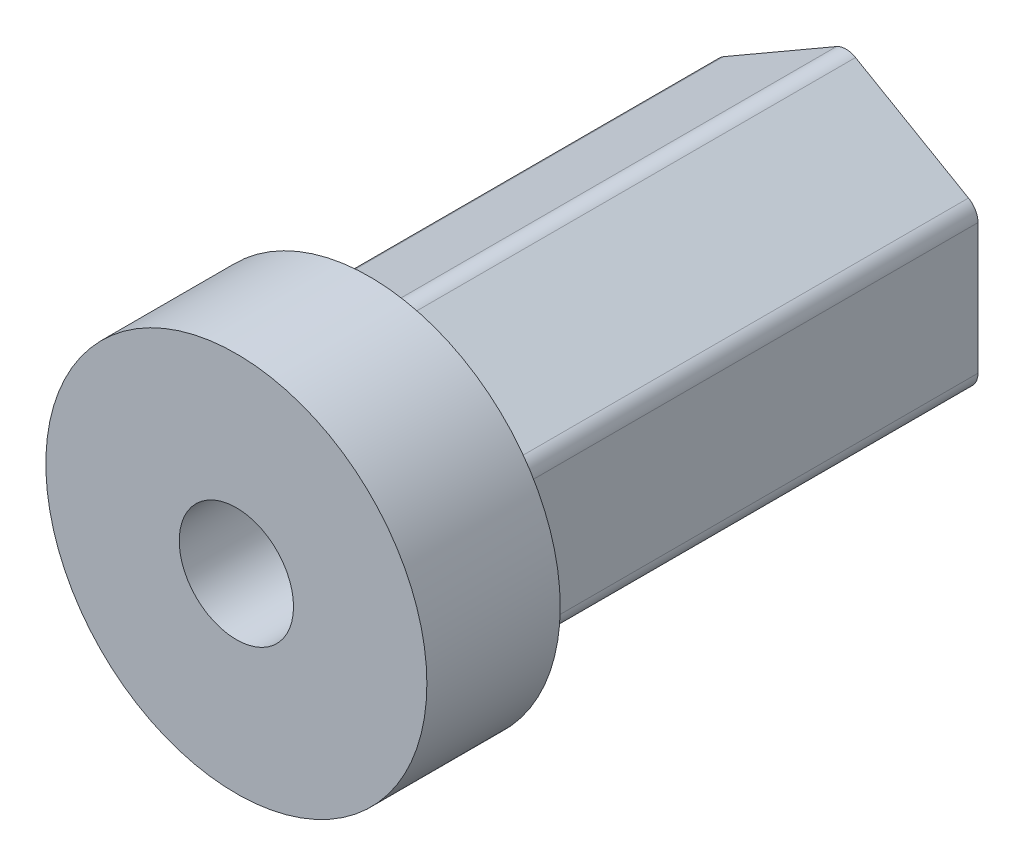
ISO-10303-21;
HEADER;
FILE_DESCRIPTION(('STEP AP214'),'2;1');
FILE_NAME('part.step','',(''),(''),'','','');
FILE_SCHEMA(('AUTOMOTIVE_DESIGN { 1 0 10303 214 1 1 1 1 }'));
ENDSEC;
DATA;
#1=APPLICATION_CONTEXT('core data for automotive mechanical design processes');
#2=APPLICATION_PROTOCOL_DEFINITION('international standard','automotive_design',2000,#1);
#3=PRODUCT_CONTEXT('',#1,'mechanical');
#4=PRODUCT('Part','Part','',(#3));
#5=PRODUCT_RELATED_PRODUCT_CATEGORY('part','',(#4));
#6=PRODUCT_DEFINITION_FORMATION('','',#4);
#7=PRODUCT_DEFINITION_CONTEXT('part definition',#1,'design');
#8=PRODUCT_DEFINITION('design','',#6,#7);
#9=PRODUCT_DEFINITION_SHAPE('','',#8);
#10=(LENGTH_UNIT() NAMED_UNIT(*) SI_UNIT(.MILLI.,.METRE.));
#11=(NAMED_UNIT(*) PLANE_ANGLE_UNIT() SI_UNIT($,.RADIAN.));
#12=(NAMED_UNIT(*) SI_UNIT($,.STERADIAN.) SOLID_ANGLE_UNIT());
#13=UNCERTAINTY_MEASURE_WITH_UNIT(LENGTH_MEASURE(1.E-05),#10,'distance_accuracy_value','');
#14=(GEOMETRIC_REPRESENTATION_CONTEXT(3) GLOBAL_UNCERTAINTY_ASSIGNED_CONTEXT((#13)) GLOBAL_UNIT_ASSIGNED_CONTEXT((#10,
#11,#12)) REPRESENTATION_CONTEXT('',''));
#15=CARTESIAN_POINT('',(0.,0.,0.));
#16=DIRECTION('',(0.,0.,1.));
#17=DIRECTION('',(1.,0.,0.));
#18=AXIS2_PLACEMENT_3D('',#15,#16,#17);
#19=CARTESIAN_POINT('',(0.,3.,-25.));
#20=DIRECTION('',(0.,0.,1.));
#21=DIRECTION('',(1.,0.,0.));
#22=AXIS2_PLACEMENT_3D('',#19,#20,#21);
#23=PLANE('',#22);
#24=CARTESIAN_POINT('',(0.,0.,-25.));
#25=DIRECTION('',(0.,0.,1.));
#26=DIRECTION('',(1.,0.,0.));
#27=AXIS2_PLACEMENT_3D('',#24,#25,#26);
#28=CIRCLE('',#27,3.);
#29=CARTESIAN_POINT('',(3.,0.,-25.));
#30=VERTEX_POINT('',#29);
#31=EDGE_CURVE('E179',#30,#30,#28,.T.);
#32=ORIENTED_EDGE('',*,*,#31,.T.);
#33=EDGE_LOOP('',(#32));
#34=FACE_BOUND('',#33,.T.);
#35=DIRECTION('',(0.,1.,0.));
#36=VECTOR('',#35,1.);
#37=CARTESIAN_POINT('',(-6.92820323027551,0.,-25.));
#38=LINE('',#37,#36);
#39=CARTESIAN_POINT('',(-6.92820323027551,-3.42264973081037,-25.));
#40=VERTEX_POINT('',#39);
#41=CARTESIAN_POINT('',(-6.9282032302755,3.42264973081038,-25.));
#42=VERTEX_POINT('',#41);
#43=EDGE_CURVE('E150',#40,#42,#38,.T.);
#44=ORIENTED_EDGE('',*,*,#43,.T.);
#45=CARTESIAN_POINT('',(-5.9282032302755,3.42264973081038,-25.));
#46=DIRECTION('',(0.,0.,1.));
#47=DIRECTION('',(1.,0.,0.));
#48=AXIS2_PLACEMENT_3D('',#45,#46,#47);
#49=CIRCLE('',#48,1.);
#50=CARTESIAN_POINT('',(-6.4282032302755,4.28867513459482,-25.));
#51=VERTEX_POINT('',#50);
#52=EDGE_CURVE('E157',#42,#51,#49,.F.);
#53=ORIENTED_EDGE('',*,*,#52,.T.);
#54=DIRECTION('',(0.86602540378444,0.499999999999998,0.));
#55=VECTOR('',#54,1.);
#56=CARTESIAN_POINT('',(-3.46410161513774,6.,-25.));
#57=LINE('',#56,#55);
#58=CARTESIAN_POINT('',(-0.499999999999981,7.71132486540519,-25.));
#59=VERTEX_POINT('',#58);
#60=EDGE_CURVE('E315',#51,#59,#57,.T.);
#61=ORIENTED_EDGE('',*,*,#60,.T.);
#62=CARTESIAN_POINT('',(0.,6.84529946162075,-25.));
#63=DIRECTION('',(0.,0.,1.));
#64=DIRECTION('',(1.,0.,0.));
#65=AXIS2_PLACEMENT_3D('',#62,#63,#64);
#66=CIRCLE('',#65,1.);
#67=CARTESIAN_POINT('',(0.500000000000017,7.71132486540518,-25.));
#68=VERTEX_POINT('',#67);
#69=EDGE_CURVE('E176',#59,#68,#66,.F.);
#70=ORIENTED_EDGE('',*,*,#69,.T.);
#71=DIRECTION('',(0.866025403784438,-0.500000000000002,0.));
#72=VECTOR('',#71,1.);
#73=CARTESIAN_POINT('',(3.46410161513777,5.99999999999999,-25.));
#74=LINE('',#73,#72);
#75=CARTESIAN_POINT('',(6.42820323027551,4.2886751345948,-25.));
#76=VERTEX_POINT('',#75);
#77=EDGE_CURVE('E234',#68,#76,#74,.T.);
#78=ORIENTED_EDGE('',*,*,#77,.T.);
#79=CARTESIAN_POINT('',(5.92820323027551,3.42264973081036,-25.));
#80=DIRECTION('',(0.,0.,1.));
#81=DIRECTION('',(1.,0.,0.));
#82=AXIS2_PLACEMENT_3D('',#79,#80,#81);
#83=CIRCLE('',#82,1.);
#84=CARTESIAN_POINT('',(6.92820323027551,3.42264973081036,-25.));
#85=VERTEX_POINT('',#84);
#86=EDGE_CURVE('E184',#76,#85,#83,.F.);
#87=ORIENTED_EDGE('',*,*,#86,.T.);
#88=DIRECTION('',(0.,-1.,0.));
#89=VECTOR('',#88,1.);
#90=CARTESIAN_POINT('',(6.92820323027551,0.,-25.));
#91=LINE('',#90,#89);
#92=CARTESIAN_POINT('',(6.9282032302755,-3.42264973081039,-25.));
#93=VERTEX_POINT('',#92);
#94=EDGE_CURVE('E235',#85,#93,#91,.T.);
#95=ORIENTED_EDGE('',*,*,#94,.T.);
#96=CARTESIAN_POINT('',(5.9282032302755,-3.42264973081039,-25.));
#97=DIRECTION('',(0.,0.,1.));
#98=DIRECTION('',(1.,0.,0.));
#99=AXIS2_PLACEMENT_3D('',#96,#97,#98);
#100=CIRCLE('',#99,1.);
#101=CARTESIAN_POINT('',(6.4282032302755,-4.28867513459483,-25.));
#102=VERTEX_POINT('',#101);
#103=EDGE_CURVE('E186',#93,#102,#100,.F.);
#104=ORIENTED_EDGE('',*,*,#103,.T.);
#105=DIRECTION('',(-0.86602540378444,-0.499999999999998,0.));
#106=VECTOR('',#105,1.);
#107=CARTESIAN_POINT('',(3.46410161513774,-6.00000000000001,-25.));
#108=LINE('',#107,#106);
#109=CARTESIAN_POINT('',(0.499999999999984,-7.71132486540519,-25.));
#110=VERTEX_POINT('',#109);
#111=EDGE_CURVE('E240',#102,#110,#108,.T.);
#112=ORIENTED_EDGE('',*,*,#111,.T.);
#113=CARTESIAN_POINT('',(0.,-6.84529946162075,-25.));
#114=DIRECTION('',(0.,0.,1.));
#115=DIRECTION('',(1.,0.,0.));
#116=AXIS2_PLACEMENT_3D('',#113,#114,#115);
#117=CIRCLE('',#116,1.);
#118=CARTESIAN_POINT('',(-0.500000000000015,-7.71132486540519,-25.));
#119=VERTEX_POINT('',#118);
#120=EDGE_CURVE('E158',#110,#119,#117,.F.);
#121=ORIENTED_EDGE('',*,*,#120,.T.);
#122=DIRECTION('',(-0.866025403784438,0.500000000000001,0.));
#123=VECTOR('',#122,1.);
#124=CARTESIAN_POINT('',(-3.46410161513777,-6.,-25.));
#125=LINE('',#124,#123);
#126=CARTESIAN_POINT('',(-6.42820323027552,-4.2886751345948,-25.));
#127=VERTEX_POINT('',#126);
#128=EDGE_CURVE('E152',#119,#127,#125,.T.);
#129=ORIENTED_EDGE('',*,*,#128,.T.);
#130=CARTESIAN_POINT('',(-5.92820323027551,-3.42264973081037,-25.));
#131=DIRECTION('',(0.,0.,1.));
#132=DIRECTION('',(1.,0.,0.));
#133=AXIS2_PLACEMENT_3D('',#130,#131,#132);
#134=CIRCLE('',#133,1.);
#135=EDGE_CURVE('E148',#127,#40,#134,.F.);
#136=ORIENTED_EDGE('',*,*,#135,.T.);
#137=EDGE_LOOP('',(#44,#53,#61,#70,#78,#87,#95,#104,#112,#121,#129,#136));
#138=FACE_BOUND('',#137,.T.);
#139=ADVANCED_FACE('F59',(#34,#138),#23,.F.);
#140=CARTESIAN_POINT('',(0.,10.,7.));
#141=DIRECTION('',(0.,0.,-1.));
#142=DIRECTION('',(-1.,0.,0.));
#143=AXIS2_PLACEMENT_3D('',#140,#141,#142);
#144=PLANE('',#143);
#145=CARTESIAN_POINT('',(0.,0.,7.));
#146=DIRECTION('',(0.,0.,1.));
#147=DIRECTION('',(1.,0.,0.));
#148=AXIS2_PLACEMENT_3D('',#145,#146,#147);
#149=CIRCLE('',#148,3.);
#150=CARTESIAN_POINT('',(3.,0.,7.));
#151=VERTEX_POINT('',#150);
#152=EDGE_CURVE('E174',#151,#151,#149,.T.);
#153=ORIENTED_EDGE('',*,*,#152,.F.);
#154=EDGE_LOOP('',(#153));
#155=FACE_BOUND('',#154,.T.);
#156=CARTESIAN_POINT('',(0.,0.,7.));
#157=DIRECTION('',(0.,0.,1.));
#158=DIRECTION('',(1.,0.,0.));
#159=AXIS2_PLACEMENT_3D('',#156,#157,#158);
#160=CIRCLE('',#159,10.);
#161=CARTESIAN_POINT('',(10.,0.,7.));
#162=VERTEX_POINT('',#161);
#163=EDGE_CURVE('E254',#162,#162,#160,.T.);
#164=ORIENTED_EDGE('',*,*,#163,.T.);
#165=EDGE_LOOP('',(#164));
#166=FACE_BOUND('',#165,.T.);
#167=ADVANCED_FACE('F268',(#155,#166),#144,.F.);
#168=CARTESIAN_POINT('',(0.,0.,0.));
#169=DIRECTION('',(0.,0.,1.));
#170=DIRECTION('',(1.,0.,0.));
#171=AXIS2_PLACEMENT_3D('',#168,#169,#170);
#172=CYLINDRICAL_SURFACE('',#171,3.);
#173=ORIENTED_EDGE('',*,*,#31,.F.);
#174=EDGE_LOOP('',(#173));
#175=FACE_BOUND('',#174,.T.);
#176=ORIENTED_EDGE('',*,*,#152,.T.);
#177=EDGE_LOOP('',(#176));
#178=FACE_BOUND('',#177,.T.);
#179=ADVANCED_FACE('F265',(#175,#178),#172,.F.);
#180=CARTESIAN_POINT('',(0.,8.,0.));
#181=DIRECTION('',(0.,0.,1.));
#182=DIRECTION('',(1.,0.,0.));
#183=AXIS2_PLACEMENT_3D('',#180,#181,#182);
#184=PLANE('',#183);
#185=CARTESIAN_POINT('',(0.,0.,0.));
#186=DIRECTION('',(0.,0.,1.));
#187=DIRECTION('',(1.,0.,0.));
#188=AXIS2_PLACEMENT_3D('',#185,#186,#187);
#189=CIRCLE('',#188,10.);
#190=CARTESIAN_POINT('',(10.,0.,0.));
#191=VERTEX_POINT('',#190);
#192=EDGE_CURVE('E259',#191,#191,#189,.T.);
#193=ORIENTED_EDGE('',*,*,#192,.F.);
#194=EDGE_LOOP('',(#193));
#195=FACE_BOUND('',#194,.T.);
#196=DIRECTION('',(0.866025403784438,-0.500000000000002,0.));
#197=VECTOR('',#196,1.);
#198=CARTESIAN_POINT('',(3.46410161513777,5.99999999999999,0.));
#199=LINE('',#198,#197);
#200=CARTESIAN_POINT('',(0.500000000000017,7.71132486540518,0.));
#201=VERTEX_POINT('',#200);
#202=CARTESIAN_POINT('',(6.42820323027551,4.2886751345948,0.));
#203=VERTEX_POINT('',#202);
#204=EDGE_CURVE('E252',#201,#203,#199,.T.);
#205=ORIENTED_EDGE('',*,*,#204,.F.);
#206=CARTESIAN_POINT('',(0.,6.84529946162075,0.));
#207=DIRECTION('',(0.,0.,1.));
#208=DIRECTION('',(1.,0.,0.));
#209=AXIS2_PLACEMENT_3D('',#206,#207,#208);
#210=CIRCLE('',#209,1.);
#211=CARTESIAN_POINT('',(-0.499999999999981,7.71132486540519,0.));
#212=VERTEX_POINT('',#211);
#213=EDGE_CURVE('E12',#201,#212,#210,.T.);
#214=ORIENTED_EDGE('',*,*,#213,.T.);
#215=DIRECTION('',(0.86602540378444,0.499999999999998,0.));
#216=VECTOR('',#215,1.);
#217=CARTESIAN_POINT('',(-3.46410161513774,6.,0.));
#218=LINE('',#217,#216);
#219=CARTESIAN_POINT('',(-6.4282032302755,4.28867513459482,0.));
#220=VERTEX_POINT('',#219);
#221=EDGE_CURVE('E169',#220,#212,#218,.T.);
#222=ORIENTED_EDGE('',*,*,#221,.F.);
#223=CARTESIAN_POINT('',(-5.9282032302755,3.42264973081038,0.));
#224=DIRECTION('',(0.,0.,1.));
#225=DIRECTION('',(1.,0.,0.));
#226=AXIS2_PLACEMENT_3D('',#223,#224,#225);
#227=CIRCLE('',#226,1.);
#228=CARTESIAN_POINT('',(-6.9282032302755,3.42264973081038,0.));
#229=VERTEX_POINT('',#228);
#230=EDGE_CURVE('E213',#220,#229,#227,.T.);
#231=ORIENTED_EDGE('',*,*,#230,.T.);
#232=DIRECTION('',(0.,1.,0.));
#233=VECTOR('',#232,1.);
#234=CARTESIAN_POINT('',(-6.92820323027551,0.,0.));
#235=LINE('',#234,#233);
#236=CARTESIAN_POINT('',(-6.92820323027551,-3.42264973081037,0.));
#237=VERTEX_POINT('',#236);
#238=EDGE_CURVE('E168',#237,#229,#235,.T.);
#239=ORIENTED_EDGE('',*,*,#238,.F.);
#240=CARTESIAN_POINT('',(-5.92820323027551,-3.42264973081037,0.));
#241=DIRECTION('',(0.,0.,1.));
#242=DIRECTION('',(1.,0.,0.));
#243=AXIS2_PLACEMENT_3D('',#240,#241,#242);
#244=CIRCLE('',#243,1.);
#245=CARTESIAN_POINT('',(-6.42820323027552,-4.2886751345948,0.));
#246=VERTEX_POINT('',#245);
#247=EDGE_CURVE('E173',#237,#246,#244,.T.);
#248=ORIENTED_EDGE('',*,*,#247,.T.);
#249=DIRECTION('',(-0.866025403784438,0.500000000000001,0.));
#250=VECTOR('',#249,1.);
#251=CARTESIAN_POINT('',(-3.46410161513777,-6.,0.));
#252=LINE('',#251,#250);
#253=CARTESIAN_POINT('',(-0.500000000000015,-7.71132486540519,0.));
#254=VERTEX_POINT('',#253);
#255=EDGE_CURVE('E244',#254,#246,#252,.T.);
#256=ORIENTED_EDGE('',*,*,#255,.F.);
#257=CARTESIAN_POINT('',(0.,-6.84529946162075,0.));
#258=DIRECTION('',(0.,0.,1.));
#259=DIRECTION('',(1.,0.,0.));
#260=AXIS2_PLACEMENT_3D('',#257,#258,#259);
#261=CIRCLE('',#260,1.);
#262=CARTESIAN_POINT('',(0.499999999999984,-7.71132486540519,0.));
#263=VERTEX_POINT('',#262);
#264=EDGE_CURVE('E216',#254,#263,#261,.T.);
#265=ORIENTED_EDGE('',*,*,#264,.T.);
#266=DIRECTION('',(-0.86602540378444,-0.499999999999998,0.));
#267=VECTOR('',#266,1.);
#268=CARTESIAN_POINT('',(3.46410161513774,-6.00000000000001,0.));
#269=LINE('',#268,#267);
#270=CARTESIAN_POINT('',(6.4282032302755,-4.28867513459483,0.));
#271=VERTEX_POINT('',#270);
#272=EDGE_CURVE('E225',#271,#263,#269,.T.);
#273=ORIENTED_EDGE('',*,*,#272,.F.);
#274=CARTESIAN_POINT('',(5.9282032302755,-3.42264973081039,0.));
#275=DIRECTION('',(0.,0.,1.));
#276=DIRECTION('',(1.,0.,0.));
#277=AXIS2_PLACEMENT_3D('',#274,#275,#276);
#278=CIRCLE('',#277,1.);
#279=CARTESIAN_POINT('',(6.9282032302755,-3.42264973081039,0.));
#280=VERTEX_POINT('',#279);
#281=EDGE_CURVE('E218',#271,#280,#278,.T.);
#282=ORIENTED_EDGE('',*,*,#281,.T.);
#283=DIRECTION('',(0.,-1.,0.));
#284=VECTOR('',#283,1.);
#285=CARTESIAN_POINT('',(6.92820323027551,0.,0.));
#286=LINE('',#285,#284);
#287=CARTESIAN_POINT('',(6.92820323027551,3.42264973081036,0.));
#288=VERTEX_POINT('',#287);
#289=EDGE_CURVE('E223',#288,#280,#286,.T.);
#290=ORIENTED_EDGE('',*,*,#289,.F.);
#291=CARTESIAN_POINT('',(5.92820323027551,3.42264973081036,0.));
#292=DIRECTION('',(0.,0.,1.));
#293=DIRECTION('',(1.,0.,0.));
#294=AXIS2_PLACEMENT_3D('',#291,#292,#293);
#295=CIRCLE('',#294,1.);
#296=EDGE_CURVE('E67',#288,#203,#295,.T.);
#297=ORIENTED_EDGE('',*,*,#296,.T.);
#298=EDGE_LOOP('',(#205,#214,#222,#231,#239,#248,#256,#265,#273,#282,#290,#297));
#299=FACE_BOUND('',#298,.T.);
#300=ADVANCED_FACE('F222',(#195,#299),#184,.F.);
#301=CARTESIAN_POINT('',(0.,0.,0.));
#302=DIRECTION('',(0.,0.,1.));
#303=DIRECTION('',(1.,0.,0.));
#304=AXIS2_PLACEMENT_3D('',#301,#302,#303);
#305=CYLINDRICAL_SURFACE('',#304,10.);
#306=ORIENTED_EDGE('',*,*,#163,.F.);
#307=EDGE_LOOP('',(#306));
#308=FACE_BOUND('',#307,.T.);
#309=ORIENTED_EDGE('',*,*,#192,.T.);
#310=EDGE_LOOP('',(#309));
#311=FACE_BOUND('',#310,.T.);
#312=ADVANCED_FACE('F277',(#308,#311),#305,.T.);
#313=CARTESIAN_POINT('',(3.46410161513777,5.99999999999999,0.));
#314=DIRECTION('',(0.500000000000002,0.866025403784438,0.));
#315=DIRECTION('',(-0.866025403784438,0.500000000000002,0.));
#316=AXIS2_PLACEMENT_3D('',#313,#314,#315);
#317=PLANE('',#316);
#318=ORIENTED_EDGE('',*,*,#204,.T.);
#319=DIRECTION('',(0.,0.,-1.));
#320=VECTOR('',#319,1.);
#321=CARTESIAN_POINT('',(6.42820323027551,4.2886751345948,0.));
#322=LINE('',#321,#320);
#323=EDGE_CURVE('E210',#203,#76,#322,.T.);
#324=ORIENTED_EDGE('',*,*,#323,.T.);
#325=ORIENTED_EDGE('',*,*,#77,.F.);
#326=DIRECTION('',(0.,0.,-1.));
#327=VECTOR('',#326,1.);
#328=CARTESIAN_POINT('',(0.500000000000017,7.71132486540518,0.));
#329=LINE('',#328,#327);
#330=EDGE_CURVE('E80',#68,#201,#329,.F.);
#331=ORIENTED_EDGE('',*,*,#330,.T.);
#332=EDGE_LOOP('',(#318,#324,#325,#331));
#333=FACE_BOUND('',#332,.T.);
#334=ADVANCED_FACE('F280',(#333),#317,.T.);
#335=CARTESIAN_POINT('',(6.92820323027551,0.,0.));
#336=DIRECTION('',(1.,0.,0.));
#337=DIRECTION('',(0.,1.,0.));
#338=AXIS2_PLACEMENT_3D('',#335,#336,#337);
#339=PLANE('',#338);
#340=ORIENTED_EDGE('',*,*,#289,.T.);
#341=DIRECTION('',(0.,0.,-1.));
#342=VECTOR('',#341,1.);
#343=CARTESIAN_POINT('',(6.9282032302755,-3.42264973081039,0.));
#344=LINE('',#343,#342);
#345=EDGE_CURVE('E206',#280,#93,#344,.T.);
#346=ORIENTED_EDGE('',*,*,#345,.T.);
#347=ORIENTED_EDGE('',*,*,#94,.F.);
#348=DIRECTION('',(0.,0.,-1.));
#349=VECTOR('',#348,1.);
#350=CARTESIAN_POINT('',(6.92820323027551,3.42264973081036,0.));
#351=LINE('',#350,#349);
#352=EDGE_CURVE('E204',#85,#288,#351,.F.);
#353=ORIENTED_EDGE('',*,*,#352,.T.);
#354=EDGE_LOOP('',(#340,#346,#347,#353));
#355=FACE_BOUND('',#354,.T.);
#356=ADVANCED_FACE('F230',(#355),#339,.T.);
#357=CARTESIAN_POINT('',(3.46410161513774,-6.00000000000001,0.));
#358=DIRECTION('',(0.499999999999998,-0.86602540378444,0.));
#359=DIRECTION('',(0.86602540378444,0.499999999999998,0.));
#360=AXIS2_PLACEMENT_3D('',#357,#358,#359);
#361=PLANE('',#360);
#362=ORIENTED_EDGE('',*,*,#272,.T.);
#363=DIRECTION('',(0.,0.,-1.));
#364=VECTOR('',#363,1.);
#365=CARTESIAN_POINT('',(0.499999999999984,-7.71132486540519,0.));
#366=LINE('',#365,#364);
#367=EDGE_CURVE('E201',#263,#110,#366,.T.);
#368=ORIENTED_EDGE('',*,*,#367,.T.);
#369=ORIENTED_EDGE('',*,*,#111,.F.);
#370=DIRECTION('',(0.,0.,-1.));
#371=VECTOR('',#370,1.);
#372=CARTESIAN_POINT('',(6.4282032302755,-4.28867513459483,0.));
#373=LINE('',#372,#371);
#374=EDGE_CURVE('E199',#102,#271,#373,.F.);
#375=ORIENTED_EDGE('',*,*,#374,.T.);
#376=EDGE_LOOP('',(#362,#368,#369,#375));
#377=FACE_BOUND('',#376,.T.);
#378=ADVANCED_FACE('F242',(#377),#361,.T.);
#379=CARTESIAN_POINT('',(-3.46410161513777,-6.,0.));
#380=DIRECTION('',(-0.500000000000001,-0.866025403784438,0.));
#381=DIRECTION('',(0.866025403784438,-0.500000000000001,0.));
#382=AXIS2_PLACEMENT_3D('',#379,#380,#381);
#383=PLANE('',#382);
#384=ORIENTED_EDGE('',*,*,#255,.T.);
#385=DIRECTION('',(0.,0.,-1.));
#386=VECTOR('',#385,1.);
#387=CARTESIAN_POINT('',(-6.42820323027552,-4.2886751345948,0.));
#388=LINE('',#387,#386);
#389=EDGE_CURVE('E197',#246,#127,#388,.T.);
#390=ORIENTED_EDGE('',*,*,#389,.T.);
#391=ORIENTED_EDGE('',*,*,#128,.F.);
#392=DIRECTION('',(0.,0.,-1.));
#393=VECTOR('',#392,1.);
#394=CARTESIAN_POINT('',(-0.500000000000015,-7.71132486540519,0.));
#395=LINE('',#394,#393);
#396=EDGE_CURVE('E195',#119,#254,#395,.F.);
#397=ORIENTED_EDGE('',*,*,#396,.T.);
#398=EDGE_LOOP('',(#384,#390,#391,#397));
#399=FACE_BOUND('',#398,.T.);
#400=ADVANCED_FACE('F329',(#399),#383,.T.);
#401=CARTESIAN_POINT('',(-6.92820323027551,0.,0.));
#402=DIRECTION('',(-1.,0.,0.));
#403=DIRECTION('',(0.,-1.,0.));
#404=AXIS2_PLACEMENT_3D('',#401,#402,#403);
#405=PLANE('',#404);
#406=ORIENTED_EDGE('',*,*,#238,.T.);
#407=DIRECTION('',(0.,0.,-1.));
#408=VECTOR('',#407,1.);
#409=CARTESIAN_POINT('',(-6.9282032302755,3.42264973081038,0.));
#410=LINE('',#409,#408);
#411=EDGE_CURVE('E167',#229,#42,#410,.T.);
#412=ORIENTED_EDGE('',*,*,#411,.T.);
#413=ORIENTED_EDGE('',*,*,#43,.F.);
#414=DIRECTION('',(0.,0.,-1.));
#415=VECTOR('',#414,1.);
#416=CARTESIAN_POINT('',(-6.92820323027551,-3.42264973081037,0.));
#417=LINE('',#416,#415);
#418=EDGE_CURVE('E164',#40,#237,#417,.F.);
#419=ORIENTED_EDGE('',*,*,#418,.T.);
#420=EDGE_LOOP('',(#406,#412,#413,#419));
#421=FACE_BOUND('',#420,.T.);
#422=ADVANCED_FACE('F163',(#421),#405,.T.);
#423=CARTESIAN_POINT('',(-3.46410161513774,6.,0.));
#424=DIRECTION('',(-0.499999999999998,0.86602540378444,0.));
#425=DIRECTION('',(-0.86602540378444,-0.499999999999998,0.));
#426=AXIS2_PLACEMENT_3D('',#423,#424,#425);
#427=PLANE('',#426);
#428=ORIENTED_EDGE('',*,*,#60,.F.);
#429=DIRECTION('',(0.,0.,-1.));
#430=VECTOR('',#429,1.);
#431=CARTESIAN_POINT('',(-6.4282032302755,4.28867513459482,0.));
#432=LINE('',#431,#430);
#433=EDGE_CURVE('E193',#51,#220,#432,.F.);
#434=ORIENTED_EDGE('',*,*,#433,.T.);
#435=ORIENTED_EDGE('',*,*,#221,.T.);
#436=DIRECTION('',(0.,0.,-1.));
#437=VECTOR('',#436,1.);
#438=CARTESIAN_POINT('',(-0.499999999999983,7.71132486540519,0.));
#439=LINE('',#438,#437);
#440=EDGE_CURVE('E190',#212,#59,#439,.T.);
#441=ORIENTED_EDGE('',*,*,#440,.T.);
#442=EDGE_LOOP('',(#428,#434,#435,#441));
#443=FACE_BOUND('',#442,.T.);
#444=ADVANCED_FACE('F296',(#443),#427,.T.);
#445=CARTESIAN_POINT('',(-5.9282032302755,3.42264973081038,0.));
#446=DIRECTION('',(0.,0.,-1.));
#447=DIRECTION('',(-1.,0.,0.));
#448=AXIS2_PLACEMENT_3D('',#445,#446,#447);
#449=CYLINDRICAL_SURFACE('',#448,1.);
#450=ORIENTED_EDGE('',*,*,#230,.F.);
#451=ORIENTED_EDGE('',*,*,#433,.F.);
#452=ORIENTED_EDGE('',*,*,#52,.F.);
#453=ORIENTED_EDGE('',*,*,#411,.F.);
#454=EDGE_LOOP('',(#450,#451,#452,#453));
#455=FACE_BOUND('',#454,.T.);
#456=ADVANCED_FACE('F293',(#455),#449,.T.);
#457=CARTESIAN_POINT('',(-5.92820323027551,-3.42264973081037,0.));
#458=DIRECTION('',(0.,0.,-1.));
#459=DIRECTION('',(-1.,0.,0.));
#460=AXIS2_PLACEMENT_3D('',#457,#458,#459);
#461=CYLINDRICAL_SURFACE('',#460,1.);
#462=ORIENTED_EDGE('',*,*,#247,.F.);
#463=ORIENTED_EDGE('',*,*,#418,.F.);
#464=ORIENTED_EDGE('',*,*,#135,.F.);
#465=ORIENTED_EDGE('',*,*,#389,.F.);
#466=EDGE_LOOP('',(#462,#463,#464,#465));
#467=FACE_BOUND('',#466,.T.);
#468=ADVANCED_FACE('F172',(#467),#461,.T.);
#469=CARTESIAN_POINT('',(0.,-6.84529946162075,0.));
#470=DIRECTION('',(0.,0.,-1.));
#471=DIRECTION('',(-1.,0.,0.));
#472=AXIS2_PLACEMENT_3D('',#469,#470,#471);
#473=CYLINDRICAL_SURFACE('',#472,1.);
#474=ORIENTED_EDGE('',*,*,#264,.F.);
#475=ORIENTED_EDGE('',*,*,#396,.F.);
#476=ORIENTED_EDGE('',*,*,#120,.F.);
#477=ORIENTED_EDGE('',*,*,#367,.F.);
#478=EDGE_LOOP('',(#474,#475,#476,#477));
#479=FACE_BOUND('',#478,.T.);
#480=ADVANCED_FACE('F300',(#479),#473,.T.);
#481=CARTESIAN_POINT('',(5.9282032302755,-3.42264973081039,0.));
#482=DIRECTION('',(0.,0.,-1.));
#483=DIRECTION('',(-1.,0.,0.));
#484=AXIS2_PLACEMENT_3D('',#481,#482,#483);
#485=CYLINDRICAL_SURFACE('',#484,1.);
#486=ORIENTED_EDGE('',*,*,#281,.F.);
#487=ORIENTED_EDGE('',*,*,#374,.F.);
#488=ORIENTED_EDGE('',*,*,#103,.F.);
#489=ORIENTED_EDGE('',*,*,#345,.F.);
#490=EDGE_LOOP('',(#486,#487,#488,#489));
#491=FACE_BOUND('',#490,.T.);
#492=ADVANCED_FACE('F237',(#491),#485,.T.);
#493=CARTESIAN_POINT('',(5.92820323027551,3.42264973081036,0.));
#494=DIRECTION('',(0.,0.,-1.));
#495=DIRECTION('',(-1.,0.,0.));
#496=AXIS2_PLACEMENT_3D('',#493,#494,#495);
#497=CYLINDRICAL_SURFACE('',#496,1.);
#498=ORIENTED_EDGE('',*,*,#296,.F.);
#499=ORIENTED_EDGE('',*,*,#352,.F.);
#500=ORIENTED_EDGE('',*,*,#86,.F.);
#501=ORIENTED_EDGE('',*,*,#323,.F.);
#502=EDGE_LOOP('',(#498,#499,#500,#501));
#503=FACE_BOUND('',#502,.T.);
#504=ADVANCED_FACE('F305',(#503),#497,.T.);
#505=CARTESIAN_POINT('',(0.,6.84529946162075,0.));
#506=DIRECTION('',(0.,0.,-1.));
#507=DIRECTION('',(-1.,0.,0.));
#508=AXIS2_PLACEMENT_3D('',#505,#506,#507);
#509=CYLINDRICAL_SURFACE('',#508,1.);
#510=ORIENTED_EDGE('',*,*,#213,.F.);
#511=ORIENTED_EDGE('',*,*,#330,.F.);
#512=ORIENTED_EDGE('',*,*,#69,.F.);
#513=ORIENTED_EDGE('',*,*,#440,.F.);
#514=EDGE_LOOP('',(#510,#511,#512,#513));
#515=FACE_BOUND('',#514,.T.);
#516=ADVANCED_FACE('F61',(#515),#509,.T.);
#517=CLOSED_SHELL('',(#139,#167,#179,#300,#312,#334,#356,#378,#400,#422,#444,#456,#468,#480,
#492,#504,#516));
#518=MANIFOLD_SOLID_BREP('B2',#517);
#519=ADVANCED_BREP_SHAPE_REPRESENTATION('',(#18,#518),#14);
#520=SHAPE_DEFINITION_REPRESENTATION(#9,#519);
ENDSEC;
END-ISO-10303-21;
